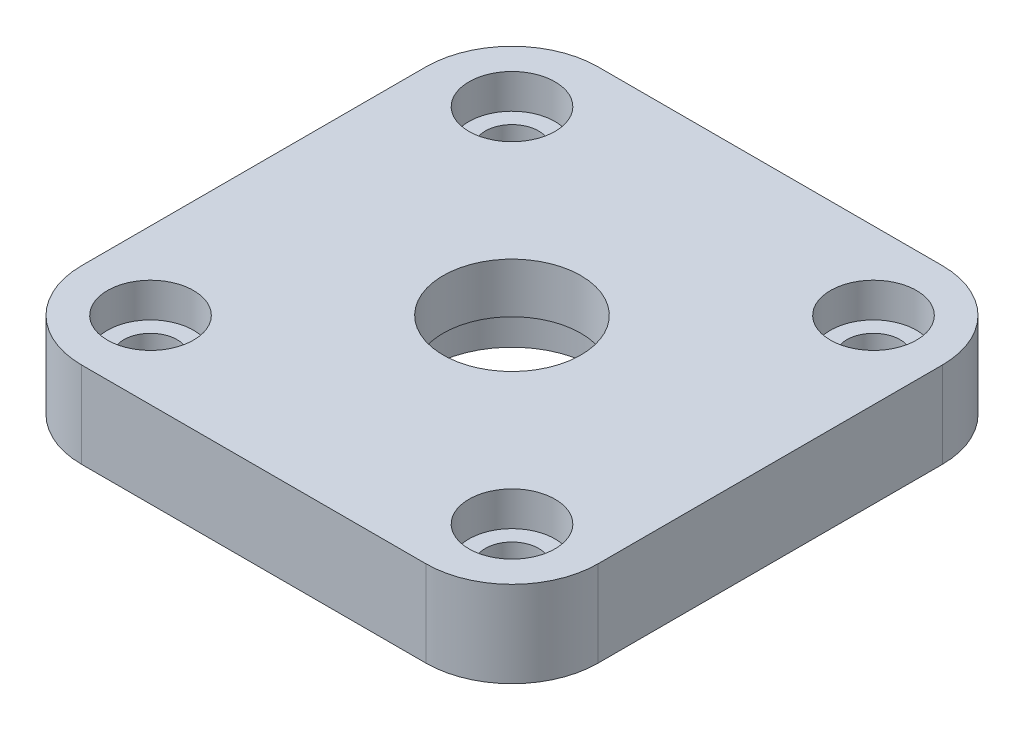
ISO-10303-21;
HEADER;
FILE_DESCRIPTION(('STEP AP214'),'2;1');
FILE_NAME('part.step','',(''),(''),'','','');
FILE_SCHEMA(('AUTOMOTIVE_DESIGN { 1 0 10303 214 1 1 1 1 }'));
ENDSEC;
DATA;
#1=APPLICATION_CONTEXT('core data for automotive mechanical design processes');
#2=APPLICATION_PROTOCOL_DEFINITION('international standard','automotive_design',2000,#1);
#3=PRODUCT_CONTEXT('',#1,'mechanical');
#4=PRODUCT('Part','Part','',(#3));
#5=PRODUCT_RELATED_PRODUCT_CATEGORY('part','',(#4));
#6=PRODUCT_DEFINITION_FORMATION('','',#4);
#7=PRODUCT_DEFINITION_CONTEXT('part definition',#1,'design');
#8=PRODUCT_DEFINITION('design','',#6,#7);
#9=PRODUCT_DEFINITION_SHAPE('','',#8);
#10=(LENGTH_UNIT() NAMED_UNIT(*) SI_UNIT(.MILLI.,.METRE.));
#11=(NAMED_UNIT(*) PLANE_ANGLE_UNIT() SI_UNIT($,.RADIAN.));
#12=(NAMED_UNIT(*) SI_UNIT($,.STERADIAN.) SOLID_ANGLE_UNIT());
#13=UNCERTAINTY_MEASURE_WITH_UNIT(LENGTH_MEASURE(1.E-05),#10,'distance_accuracy_value','');
#14=(GEOMETRIC_REPRESENTATION_CONTEXT(3) GLOBAL_UNCERTAINTY_ASSIGNED_CONTEXT((#13)) GLOBAL_UNIT_ASSIGNED_CONTEXT((#10,
#11,#12)) REPRESENTATION_CONTEXT('',''));
#15=CARTESIAN_POINT('',(0.,0.,0.));
#16=DIRECTION('',(0.,0.,1.));
#17=DIRECTION('',(1.,0.,0.));
#18=AXIS2_PLACEMENT_3D('',#15,#16,#17);
#19=CARTESIAN_POINT('',(-10.5,0.,-10.5));
#20=DIRECTION('',(0.,1.,0.));
#21=DIRECTION('',(0.,0.,1.));
#22=AXIS2_PLACEMENT_3D('',#19,#20,#21);
#23=CYLINDRICAL_SURFACE('',#22,1.55);
#24=CARTESIAN_POINT('',(-10.5,0.,-10.5));
#25=DIRECTION('',(0.,1.,0.));
#26=DIRECTION('',(0.,0.,1.));
#27=AXIS2_PLACEMENT_3D('',#24,#25,#26);
#28=CIRCLE('',#27,1.55);
#29=CARTESIAN_POINT('',(-10.5,0.,-8.94999999999995));
#30=VERTEX_POINT('',#29);
#31=EDGE_CURVE('E192',#30,#30,#28,.T.);
#32=ORIENTED_EDGE('',*,*,#31,.F.);
#33=EDGE_LOOP('',(#32));
#34=FACE_BOUND('',#33,.T.);
#35=CARTESIAN_POINT('',(-10.5,3.,-10.5));
#36=DIRECTION('',(0.,1.,0.));
#37=DIRECTION('',(0.,0.,1.));
#38=AXIS2_PLACEMENT_3D('',#35,#36,#37);
#39=CIRCLE('',#38,1.55);
#40=CARTESIAN_POINT('',(-10.5,3.,-8.94999999999995));
#41=VERTEX_POINT('',#40);
#42=EDGE_CURVE('E42',#41,#41,#39,.F.);
#43=ORIENTED_EDGE('',*,*,#42,.F.);
#44=EDGE_LOOP('',(#43));
#45=FACE_BOUND('',#44,.T.);
#46=ADVANCED_FACE('F38',(#34,#45),#23,.F.);
#47=CARTESIAN_POINT('',(10.5,0.,-10.5000000000001));
#48=DIRECTION('',(0.,1.,0.));
#49=DIRECTION('',(0.,0.,1.));
#50=AXIS2_PLACEMENT_3D('',#47,#48,#49);
#51=CYLINDRICAL_SURFACE('',#50,1.55);
#52=CARTESIAN_POINT('',(10.5,0.,-10.5000000000001));
#53=DIRECTION('',(0.,1.,0.));
#54=DIRECTION('',(0.,0.,1.));
#55=AXIS2_PLACEMENT_3D('',#52,#53,#54);
#56=CIRCLE('',#55,1.55);
#57=CARTESIAN_POINT('',(10.5,0.,-8.95000000000007));
#58=VERTEX_POINT('',#57);
#59=EDGE_CURVE('E189',#58,#58,#56,.T.);
#60=ORIENTED_EDGE('',*,*,#59,.F.);
#61=EDGE_LOOP('',(#60));
#62=FACE_BOUND('',#61,.T.);
#63=CARTESIAN_POINT('',(10.5,3.,-10.5000000000001));
#64=DIRECTION('',(0.,1.,0.));
#65=DIRECTION('',(0.,0.,1.));
#66=AXIS2_PLACEMENT_3D('',#63,#64,#65);
#67=CIRCLE('',#66,1.55);
#68=CARTESIAN_POINT('',(10.5,3.,-8.95000000000007));
#69=VERTEX_POINT('',#68);
#70=EDGE_CURVE('E173',#69,#69,#67,.F.);
#71=ORIENTED_EDGE('',*,*,#70,.F.);
#72=EDGE_LOOP('',(#71));
#73=FACE_BOUND('',#72,.T.);
#74=ADVANCED_FACE('F231',(#62,#73),#51,.F.);
#75=CARTESIAN_POINT('',(10.5,0.,10.5));
#76=DIRECTION('',(0.,1.,0.));
#77=DIRECTION('',(0.,0.,1.));
#78=AXIS2_PLACEMENT_3D('',#75,#76,#77);
#79=CYLINDRICAL_SURFACE('',#78,1.55);
#80=CARTESIAN_POINT('',(10.5,0.,10.5));
#81=DIRECTION('',(0.,1.,0.));
#82=DIRECTION('',(0.,0.,1.));
#83=AXIS2_PLACEMENT_3D('',#80,#81,#82);
#84=CIRCLE('',#83,1.55);
#85=CARTESIAN_POINT('',(10.5,0.,12.05));
#86=VERTEX_POINT('',#85);
#87=EDGE_CURVE('E193',#86,#86,#84,.T.);
#88=ORIENTED_EDGE('',*,*,#87,.F.);
#89=EDGE_LOOP('',(#88));
#90=FACE_BOUND('',#89,.T.);
#91=CARTESIAN_POINT('',(10.5,3.,10.5));
#92=DIRECTION('',(0.,1.,0.));
#93=DIRECTION('',(0.,0.,1.));
#94=AXIS2_PLACEMENT_3D('',#91,#92,#93);
#95=CIRCLE('',#94,1.55);
#96=CARTESIAN_POINT('',(10.5,3.,12.05));
#97=VERTEX_POINT('',#96);
#98=EDGE_CURVE('E170',#97,#97,#95,.F.);
#99=ORIENTED_EDGE('',*,*,#98,.F.);
#100=EDGE_LOOP('',(#99));
#101=FACE_BOUND('',#100,.T.);
#102=ADVANCED_FACE('F237',(#90,#101),#79,.F.);
#103=CARTESIAN_POINT('',(-10.5,0.,10.5));
#104=DIRECTION('',(0.,1.,0.));
#105=DIRECTION('',(0.,0.,1.));
#106=AXIS2_PLACEMENT_3D('',#103,#104,#105);
#107=CYLINDRICAL_SURFACE('',#106,1.55);
#108=CARTESIAN_POINT('',(-10.5,0.,10.5));
#109=DIRECTION('',(0.,1.,0.));
#110=DIRECTION('',(0.,0.,1.));
#111=AXIS2_PLACEMENT_3D('',#108,#109,#110);
#112=CIRCLE('',#111,1.55);
#113=CARTESIAN_POINT('',(-10.5,0.,12.05));
#114=VERTEX_POINT('',#113);
#115=EDGE_CURVE('E144',#114,#114,#112,.T.);
#116=ORIENTED_EDGE('',*,*,#115,.F.);
#117=EDGE_LOOP('',(#116));
#118=FACE_BOUND('',#117,.T.);
#119=CARTESIAN_POINT('',(-10.5,3.,10.5));
#120=DIRECTION('',(0.,1.,0.));
#121=DIRECTION('',(0.,0.,1.));
#122=AXIS2_PLACEMENT_3D('',#119,#120,#121);
#123=CIRCLE('',#122,1.55);
#124=CARTESIAN_POINT('',(-10.5,3.,12.05));
#125=VERTEX_POINT('',#124);
#126=EDGE_CURVE('E167',#125,#125,#123,.F.);
#127=ORIENTED_EDGE('',*,*,#126,.F.);
#128=EDGE_LOOP('',(#127));
#129=FACE_BOUND('',#128,.T.);
#130=ADVANCED_FACE('F244',(#118,#129),#107,.F.);
#131=CARTESIAN_POINT('',(0.,0.,0.));
#132=DIRECTION('',(0.,1.,0.));
#133=DIRECTION('',(0.,0.,1.));
#134=AXIS2_PLACEMENT_3D('',#131,#132,#133);
#135=CYLINDRICAL_SURFACE('',#134,4.);
#136=CARTESIAN_POINT('',(0.,5.,0.));
#137=DIRECTION('',(0.,-1.,0.));
#138=DIRECTION('',(0.,0.,-1.));
#139=AXIS2_PLACEMENT_3D('',#136,#137,#138);
#140=CIRCLE('',#139,4.);
#141=CARTESIAN_POINT('',(0.,5.,-4.));
#142=VERTEX_POINT('',#141);
#143=EDGE_CURVE('E200',#142,#142,#140,.T.);
#144=ORIENTED_EDGE('',*,*,#143,.F.);
#145=EDGE_LOOP('',(#144));
#146=FACE_BOUND('',#145,.T.);
#147=CARTESIAN_POINT('',(0.,2.1,0.));
#148=DIRECTION('',(0.,-1.,0.));
#149=DIRECTION('',(0.,0.,-1.));
#150=AXIS2_PLACEMENT_3D('',#147,#148,#149);
#151=CIRCLE('',#150,4.);
#152=CARTESIAN_POINT('',(0.,2.1,-4.));
#153=VERTEX_POINT('',#152);
#154=EDGE_CURVE('E141',#153,#153,#151,.F.);
#155=ORIENTED_EDGE('',*,*,#154,.F.);
#156=EDGE_LOOP('',(#155));
#157=FACE_BOUND('',#156,.T.);
#158=ADVANCED_FACE('F246',(#146,#157),#135,.F.);
#159=CARTESIAN_POINT('',(15.,5.,15.));
#160=DIRECTION('',(-1.,0.,0.));
#161=DIRECTION('',(0.,0.,1.));
#162=AXIS2_PLACEMENT_3D('',#159,#160,#161);
#163=PLANE('',#162);
#164=DIRECTION('',(0.,0.,-1.));
#165=VECTOR('',#164,1.);
#166=CARTESIAN_POINT('',(15.,0.,15.));
#167=LINE('',#166,#165);
#168=CARTESIAN_POINT('',(15.,0.,10.));
#169=VERTEX_POINT('',#168);
#170=CARTESIAN_POINT('',(15.,0.,-10.));
#171=VERTEX_POINT('',#170);
#172=EDGE_CURVE('E202',#169,#171,#167,.T.);
#173=ORIENTED_EDGE('',*,*,#172,.T.);
#174=DIRECTION('',(0.,-1.,0.));
#175=VECTOR('',#174,1.);
#176=CARTESIAN_POINT('',(15.,5.,-10.));
#177=LINE('',#176,#175);
#178=CARTESIAN_POINT('',(15.,5.,-10.));
#179=VERTEX_POINT('',#178);
#180=EDGE_CURVE('E11',#171,#179,#177,.F.);
#181=ORIENTED_EDGE('',*,*,#180,.T.);
#182=DIRECTION('',(0.,0.,-1.));
#183=VECTOR('',#182,1.);
#184=CARTESIAN_POINT('',(15.,5.,15.));
#185=LINE('',#184,#183);
#186=CARTESIAN_POINT('',(15.,5.,10.));
#187=VERTEX_POINT('',#186);
#188=EDGE_CURVE('E132',#187,#179,#185,.T.);
#189=ORIENTED_EDGE('',*,*,#188,.F.);
#190=DIRECTION('',(0.,-1.,0.));
#191=VECTOR('',#190,1.);
#192=CARTESIAN_POINT('',(15.,5.,10.));
#193=LINE('',#192,#191);
#194=EDGE_CURVE('E47',#187,#169,#193,.T.);
#195=ORIENTED_EDGE('',*,*,#194,.T.);
#196=EDGE_LOOP('',(#173,#181,#189,#195));
#197=FACE_BOUND('',#196,.T.);
#198=ADVANCED_FACE('F228',(#197),#163,.F.);
#199=CARTESIAN_POINT('',(-15.,5.,-15.));
#200=DIRECTION('',(0.,0.,1.));
#201=DIRECTION('',(1.,0.,0.));
#202=AXIS2_PLACEMENT_3D('',#199,#200,#201);
#203=PLANE('',#202);
#204=DIRECTION('',(-1.,0.,0.));
#205=VECTOR('',#204,1.);
#206=CARTESIAN_POINT('',(-15.,0.,-15.));
#207=LINE('',#206,#205);
#208=CARTESIAN_POINT('',(10.,0.,-15.));
#209=VERTEX_POINT('',#208);
#210=CARTESIAN_POINT('',(-10.,0.,-15.));
#211=VERTEX_POINT('',#210);
#212=EDGE_CURVE('E137',#209,#211,#207,.T.);
#213=ORIENTED_EDGE('',*,*,#212,.T.);
#214=DIRECTION('',(0.,-1.,0.));
#215=VECTOR('',#214,1.);
#216=CARTESIAN_POINT('',(-10.,5.,-15.));
#217=LINE('',#216,#215);
#218=CARTESIAN_POINT('',(-10.,5.,-15.));
#219=VERTEX_POINT('',#218);
#220=EDGE_CURVE('E55',#211,#219,#217,.F.);
#221=ORIENTED_EDGE('',*,*,#220,.T.);
#222=DIRECTION('',(-1.,0.,0.));
#223=VECTOR('',#222,1.);
#224=CARTESIAN_POINT('',(-15.,5.,-15.));
#225=LINE('',#224,#223);
#226=CARTESIAN_POINT('',(10.,5.,-15.));
#227=VERTEX_POINT('',#226);
#228=EDGE_CURVE('E135',#227,#219,#225,.T.);
#229=ORIENTED_EDGE('',*,*,#228,.F.);
#230=DIRECTION('',(0.,-1.,0.));
#231=VECTOR('',#230,1.);
#232=CARTESIAN_POINT('',(10.,5.,-15.));
#233=LINE('',#232,#231);
#234=EDGE_CURVE('E161',#227,#209,#233,.T.);
#235=ORIENTED_EDGE('',*,*,#234,.T.);
#236=EDGE_LOOP('',(#213,#221,#229,#235));
#237=FACE_BOUND('',#236,.T.);
#238=ADVANCED_FACE('F211',(#237),#203,.F.);
#239=CARTESIAN_POINT('',(-15.,5.,15.));
#240=DIRECTION('',(1.,0.,0.));
#241=DIRECTION('',(0.,0.,-1.));
#242=AXIS2_PLACEMENT_3D('',#239,#240,#241);
#243=PLANE('',#242);
#244=DIRECTION('',(0.,0.,1.));
#245=VECTOR('',#244,1.);
#246=CARTESIAN_POINT('',(-15.,0.,15.));
#247=LINE('',#246,#245);
#248=CARTESIAN_POINT('',(-15.,0.,-10.));
#249=VERTEX_POINT('',#248);
#250=CARTESIAN_POINT('',(-15.,0.,10.));
#251=VERTEX_POINT('',#250);
#252=EDGE_CURVE('E133',#249,#251,#247,.T.);
#253=ORIENTED_EDGE('',*,*,#252,.T.);
#254=DIRECTION('',(0.,-1.,0.));
#255=VECTOR('',#254,1.);
#256=CARTESIAN_POINT('',(-15.,5.,10.));
#257=LINE('',#256,#255);
#258=CARTESIAN_POINT('',(-15.,5.,10.));
#259=VERTEX_POINT('',#258);
#260=EDGE_CURVE('E111',#251,#259,#257,.F.);
#261=ORIENTED_EDGE('',*,*,#260,.T.);
#262=DIRECTION('',(0.,0.,1.));
#263=VECTOR('',#262,1.);
#264=CARTESIAN_POINT('',(-15.,5.,15.));
#265=LINE('',#264,#263);
#266=CARTESIAN_POINT('',(-15.,5.,-10.));
#267=VERTEX_POINT('',#266);
#268=EDGE_CURVE('E205',#267,#259,#265,.T.);
#269=ORIENTED_EDGE('',*,*,#268,.F.);
#270=DIRECTION('',(0.,-1.,0.));
#271=VECTOR('',#270,1.);
#272=CARTESIAN_POINT('',(-15.,5.,-10.));
#273=LINE('',#272,#271);
#274=EDGE_CURVE('E116',#267,#249,#273,.T.);
#275=ORIENTED_EDGE('',*,*,#274,.T.);
#276=EDGE_LOOP('',(#253,#261,#269,#275));
#277=FACE_BOUND('',#276,.T.);
#278=ADVANCED_FACE('F220',(#277),#243,.F.);
#279=CARTESIAN_POINT('',(-15.,5.,15.));
#280=DIRECTION('',(0.,0.,-1.));
#281=DIRECTION('',(-1.,0.,0.));
#282=AXIS2_PLACEMENT_3D('',#279,#280,#281);
#283=PLANE('',#282);
#284=DIRECTION('',(1.,0.,0.));
#285=VECTOR('',#284,1.);
#286=CARTESIAN_POINT('',(-15.,5.,15.));
#287=LINE('',#286,#285);
#288=CARTESIAN_POINT('',(-10.,5.,15.));
#289=VERTEX_POINT('',#288);
#290=CARTESIAN_POINT('',(10.,5.,15.));
#291=VERTEX_POINT('',#290);
#292=EDGE_CURVE('E126',#289,#291,#287,.T.);
#293=ORIENTED_EDGE('',*,*,#292,.F.);
#294=DIRECTION('',(0.,-1.,0.));
#295=VECTOR('',#294,1.);
#296=CARTESIAN_POINT('',(-10.,5.,15.));
#297=LINE('',#296,#295);
#298=CARTESIAN_POINT('',(-10.,0.,15.));
#299=VERTEX_POINT('',#298);
#300=EDGE_CURVE('E110',#289,#299,#297,.T.);
#301=ORIENTED_EDGE('',*,*,#300,.T.);
#302=DIRECTION('',(1.,0.,0.));
#303=VECTOR('',#302,1.);
#304=CARTESIAN_POINT('',(-15.,0.,15.));
#305=LINE('',#304,#303);
#306=CARTESIAN_POINT('',(10.,0.,15.));
#307=VERTEX_POINT('',#306);
#308=EDGE_CURVE('E123',#299,#307,#305,.T.);
#309=ORIENTED_EDGE('',*,*,#308,.T.);
#310=DIRECTION('',(0.,-1.,0.));
#311=VECTOR('',#310,1.);
#312=CARTESIAN_POINT('',(10.,5.,15.));
#313=LINE('',#312,#311);
#314=EDGE_CURVE('E128',#307,#291,#313,.F.);
#315=ORIENTED_EDGE('',*,*,#314,.T.);
#316=EDGE_LOOP('',(#293,#301,#309,#315));
#317=FACE_BOUND('',#316,.T.);
#318=ADVANCED_FACE('F122',(#317),#283,.F.);
#319=CARTESIAN_POINT('',(0.,5.,0.));
#320=DIRECTION('',(0.,-1.,0.));
#321=DIRECTION('',(0.,0.,-1.));
#322=AXIS2_PLACEMENT_3D('',#319,#320,#321);
#323=PLANE('',#322);
#324=CARTESIAN_POINT('',(10.5,5.,-10.5000000000001));
#325=DIRECTION('',(0.,1.,0.));
#326=DIRECTION('',(0.,0.,1.));
#327=AXIS2_PLACEMENT_3D('',#324,#325,#326);
#328=CIRCLE('',#327,2.5);
#329=CARTESIAN_POINT('',(10.5,5.,-8.00000000000006));
#330=VERTEX_POINT('',#329);
#331=EDGE_CURVE('E490',#330,#330,#328,.T.);
#332=ORIENTED_EDGE('',*,*,#331,.F.);
#333=EDGE_LOOP('',(#332));
#334=FACE_BOUND('',#333,.T.);
#335=CARTESIAN_POINT('',(-10.5,5.,10.5));
#336=DIRECTION('',(0.,1.,0.));
#337=DIRECTION('',(0.,0.,1.));
#338=AXIS2_PLACEMENT_3D('',#335,#336,#337);
#339=CIRCLE('',#338,2.5);
#340=CARTESIAN_POINT('',(-10.5,5.,13.));
#341=VERTEX_POINT('',#340);
#342=EDGE_CURVE('E493',#341,#341,#339,.T.);
#343=ORIENTED_EDGE('',*,*,#342,.F.);
#344=EDGE_LOOP('',(#343));
#345=FACE_BOUND('',#344,.T.);
#346=CARTESIAN_POINT('',(10.5,5.,10.5));
#347=DIRECTION('',(0.,1.,0.));
#348=DIRECTION('',(0.,0.,1.));
#349=AXIS2_PLACEMENT_3D('',#346,#347,#348);
#350=CIRCLE('',#349,2.5);
#351=CARTESIAN_POINT('',(10.5,5.,13.));
#352=VERTEX_POINT('',#351);
#353=EDGE_CURVE('E502',#352,#352,#350,.T.);
#354=ORIENTED_EDGE('',*,*,#353,.F.);
#355=EDGE_LOOP('',(#354));
#356=FACE_BOUND('',#355,.T.);
#357=CARTESIAN_POINT('',(-10.5,5.,-10.5));
#358=DIRECTION('',(0.,1.,0.));
#359=DIRECTION('',(0.,0.,1.));
#360=AXIS2_PLACEMENT_3D('',#357,#358,#359);
#361=CIRCLE('',#360,2.5);
#362=CARTESIAN_POINT('',(-10.5,5.,-7.99999999999995));
#363=VERTEX_POINT('',#362);
#364=EDGE_CURVE('E485',#363,#363,#361,.T.);
#365=ORIENTED_EDGE('',*,*,#364,.F.);
#366=EDGE_LOOP('',(#365));
#367=FACE_BOUND('',#366,.T.);
#368=ORIENTED_EDGE('',*,*,#143,.T.);
#369=EDGE_LOOP('',(#368));
#370=FACE_BOUND('',#369,.T.);
#371=ORIENTED_EDGE('',*,*,#268,.T.);
#372=CARTESIAN_POINT('',(-10.,5.,10.));
#373=DIRECTION('',(0.,-1.,0.));
#374=DIRECTION('',(0.,0.,-1.));
#375=AXIS2_PLACEMENT_3D('',#372,#373,#374);
#376=CIRCLE('',#375,5.);
#377=EDGE_CURVE('E159',#259,#289,#376,.F.);
#378=ORIENTED_EDGE('',*,*,#377,.T.);
#379=ORIENTED_EDGE('',*,*,#292,.T.);
#380=CARTESIAN_POINT('',(10.,5.,10.));
#381=DIRECTION('',(0.,-1.,0.));
#382=DIRECTION('',(0.,0.,-1.));
#383=AXIS2_PLACEMENT_3D('',#380,#381,#382);
#384=CIRCLE('',#383,5.);
#385=EDGE_CURVE('E154',#291,#187,#384,.F.);
#386=ORIENTED_EDGE('',*,*,#385,.T.);
#387=ORIENTED_EDGE('',*,*,#188,.T.);
#388=CARTESIAN_POINT('',(10.,5.,-10.));
#389=DIRECTION('',(0.,-1.,0.));
#390=DIRECTION('',(0.,0.,-1.));
#391=AXIS2_PLACEMENT_3D('',#388,#389,#390);
#392=CIRCLE('',#391,5.);
#393=EDGE_CURVE('E62',#179,#227,#392,.F.);
#394=ORIENTED_EDGE('',*,*,#393,.T.);
#395=ORIENTED_EDGE('',*,*,#228,.T.);
#396=CARTESIAN_POINT('',(-10.,5.,-10.));
#397=DIRECTION('',(0.,-1.,0.));
#398=DIRECTION('',(0.,0.,-1.));
#399=AXIS2_PLACEMENT_3D('',#396,#397,#398);
#400=CIRCLE('',#399,5.);
#401=EDGE_CURVE('E157',#219,#267,#400,.F.);
#402=ORIENTED_EDGE('',*,*,#401,.T.);
#403=EDGE_LOOP('',(#371,#378,#379,#386,#387,#394,#395,#402));
#404=FACE_BOUND('',#403,.T.);
#405=ADVANCED_FACE('F218',(#334,#345,#356,#367,#370,#404),#323,.F.);
#406=CARTESIAN_POINT('',(0.,0.,0.));
#407=DIRECTION('',(0.,-1.,0.));
#408=DIRECTION('',(0.,0.,-1.));
#409=AXIS2_PLACEMENT_3D('',#406,#407,#408);
#410=PLANE('',#409);
#411=CARTESIAN_POINT('',(0.,0.,0.));
#412=DIRECTION('',(0.,-1.,0.));
#413=DIRECTION('',(0.,0.,-1.));
#414=AXIS2_PLACEMENT_3D('',#411,#412,#413);
#415=CIRCLE('',#414,4.8);
#416=CARTESIAN_POINT('',(0.,0.,-4.8));
#417=VERTEX_POINT('',#416);
#418=EDGE_CURVE('E178',#417,#417,#415,.T.);
#419=ORIENTED_EDGE('',*,*,#418,.F.);
#420=EDGE_LOOP('',(#419));
#421=FACE_BOUND('',#420,.T.);
#422=ORIENTED_EDGE('',*,*,#115,.T.);
#423=EDGE_LOOP('',(#422));
#424=FACE_BOUND('',#423,.T.);
#425=ORIENTED_EDGE('',*,*,#87,.T.);
#426=EDGE_LOOP('',(#425));
#427=FACE_BOUND('',#426,.T.);
#428=ORIENTED_EDGE('',*,*,#59,.T.);
#429=EDGE_LOOP('',(#428));
#430=FACE_BOUND('',#429,.T.);
#431=ORIENTED_EDGE('',*,*,#31,.T.);
#432=EDGE_LOOP('',(#431));
#433=FACE_BOUND('',#432,.T.);
#434=ORIENTED_EDGE('',*,*,#308,.F.);
#435=CARTESIAN_POINT('',(-10.,0.,10.));
#436=DIRECTION('',(0.,-1.,0.));
#437=DIRECTION('',(0.,0.,-1.));
#438=AXIS2_PLACEMENT_3D('',#435,#436,#437);
#439=CIRCLE('',#438,5.);
#440=EDGE_CURVE('E106',#299,#251,#439,.T.);
#441=ORIENTED_EDGE('',*,*,#440,.T.);
#442=ORIENTED_EDGE('',*,*,#252,.F.);
#443=CARTESIAN_POINT('',(-10.,0.,-10.));
#444=DIRECTION('',(0.,-1.,0.));
#445=DIRECTION('',(0.,0.,-1.));
#446=AXIS2_PLACEMENT_3D('',#443,#444,#445);
#447=CIRCLE('',#446,5.);
#448=EDGE_CURVE('E117',#249,#211,#447,.T.);
#449=ORIENTED_EDGE('',*,*,#448,.T.);
#450=ORIENTED_EDGE('',*,*,#212,.F.);
#451=CARTESIAN_POINT('',(10.,0.,-10.));
#452=DIRECTION('',(0.,-1.,0.));
#453=DIRECTION('',(0.,0.,-1.));
#454=AXIS2_PLACEMENT_3D('',#451,#452,#453);
#455=CIRCLE('',#454,5.);
#456=EDGE_CURVE('E148',#209,#171,#455,.T.);
#457=ORIENTED_EDGE('',*,*,#456,.T.);
#458=ORIENTED_EDGE('',*,*,#172,.F.);
#459=CARTESIAN_POINT('',(10.,0.,10.));
#460=DIRECTION('',(0.,-1.,0.));
#461=DIRECTION('',(0.,0.,-1.));
#462=AXIS2_PLACEMENT_3D('',#459,#460,#461);
#463=CIRCLE('',#462,5.);
#464=EDGE_CURVE('E127',#169,#307,#463,.T.);
#465=ORIENTED_EDGE('',*,*,#464,.T.);
#466=EDGE_LOOP('',(#434,#441,#442,#449,#450,#457,#458,#465));
#467=FACE_BOUND('',#466,.T.);
#468=ADVANCED_FACE('F130',(#421,#424,#427,#430,#433,#467),#410,.T.);
#469=CARTESIAN_POINT('',(0.,2.1,0.));
#470=DIRECTION('',(0.,-1.,0.));
#471=DIRECTION('',(0.,0.,-1.));
#472=AXIS2_PLACEMENT_3D('',#469,#470,#471);
#473=PLANE('',#472);
#474=CARTESIAN_POINT('',(0.,2.1,0.));
#475=DIRECTION('',(0.,-1.,0.));
#476=DIRECTION('',(0.,0.,-1.));
#477=AXIS2_PLACEMENT_3D('',#474,#475,#476);
#478=CIRCLE('',#477,4.8);
#479=CARTESIAN_POINT('',(0.,2.1,-4.8));
#480=VERTEX_POINT('',#479);
#481=EDGE_CURVE('E145',#480,#480,#478,.T.);
#482=ORIENTED_EDGE('',*,*,#481,.T.);
#483=EDGE_LOOP('',(#482));
#484=FACE_BOUND('',#483,.T.);
#485=ORIENTED_EDGE('',*,*,#154,.T.);
#486=EDGE_LOOP('',(#485));
#487=FACE_BOUND('',#486,.T.);
#488=ADVANCED_FACE('F254',(#484,#487),#473,.T.);
#489=CARTESIAN_POINT('',(0.,2.1,0.));
#490=DIRECTION('',(0.,-1.,0.));
#491=DIRECTION('',(0.,0.,-1.));
#492=AXIS2_PLACEMENT_3D('',#489,#490,#491);
#493=CYLINDRICAL_SURFACE('',#492,4.8);
#494=ORIENTED_EDGE('',*,*,#481,.F.);
#495=EDGE_LOOP('',(#494));
#496=FACE_BOUND('',#495,.T.);
#497=ORIENTED_EDGE('',*,*,#418,.T.);
#498=EDGE_LOOP('',(#497));
#499=FACE_BOUND('',#498,.T.);
#500=ADVANCED_FACE('F259',(#496,#499),#493,.F.);
#501=CARTESIAN_POINT('',(-10.,5.,10.));
#502=DIRECTION('',(0.,-1.,0.));
#503=DIRECTION('',(0.,0.,-1.));
#504=AXIS2_PLACEMENT_3D('',#501,#502,#503);
#505=CYLINDRICAL_SURFACE('',#504,5.);
#506=ORIENTED_EDGE('',*,*,#377,.F.);
#507=ORIENTED_EDGE('',*,*,#260,.F.);
#508=ORIENTED_EDGE('',*,*,#440,.F.);
#509=ORIENTED_EDGE('',*,*,#300,.F.);
#510=EDGE_LOOP('',(#506,#507,#508,#509));
#511=FACE_BOUND('',#510,.T.);
#512=ADVANCED_FACE('F109',(#511),#505,.T.);
#513=CARTESIAN_POINT('',(-10.,5.,-10.));
#514=DIRECTION('',(0.,-1.,0.));
#515=DIRECTION('',(0.,0.,-1.));
#516=AXIS2_PLACEMENT_3D('',#513,#514,#515);
#517=CYLINDRICAL_SURFACE('',#516,5.);
#518=ORIENTED_EDGE('',*,*,#401,.F.);
#519=ORIENTED_EDGE('',*,*,#220,.F.);
#520=ORIENTED_EDGE('',*,*,#448,.F.);
#521=ORIENTED_EDGE('',*,*,#274,.F.);
#522=EDGE_LOOP('',(#518,#519,#520,#521));
#523=FACE_BOUND('',#522,.T.);
#524=ADVANCED_FACE('F215',(#523),#517,.T.);
#525=CARTESIAN_POINT('',(10.,5.,-10.));
#526=DIRECTION('',(0.,-1.,0.));
#527=DIRECTION('',(0.,0.,-1.));
#528=AXIS2_PLACEMENT_3D('',#525,#526,#527);
#529=CYLINDRICAL_SURFACE('',#528,5.);
#530=ORIENTED_EDGE('',*,*,#393,.F.);
#531=ORIENTED_EDGE('',*,*,#180,.F.);
#532=ORIENTED_EDGE('',*,*,#456,.F.);
#533=ORIENTED_EDGE('',*,*,#234,.F.);
#534=EDGE_LOOP('',(#530,#531,#532,#533));
#535=FACE_BOUND('',#534,.T.);
#536=ADVANCED_FACE('F324',(#535),#529,.T.);
#537=CARTESIAN_POINT('',(10.,5.,10.));
#538=DIRECTION('',(0.,-1.,0.));
#539=DIRECTION('',(0.,0.,-1.));
#540=AXIS2_PLACEMENT_3D('',#537,#538,#539);
#541=CYLINDRICAL_SURFACE('',#540,5.);
#542=ORIENTED_EDGE('',*,*,#385,.F.);
#543=ORIENTED_EDGE('',*,*,#314,.F.);
#544=ORIENTED_EDGE('',*,*,#464,.F.);
#545=ORIENTED_EDGE('',*,*,#194,.F.);
#546=EDGE_LOOP('',(#542,#543,#544,#545));
#547=FACE_BOUND('',#546,.T.);
#548=ADVANCED_FACE('F40',(#547),#541,.T.);
#549=CARTESIAN_POINT('',(-10.5,3.,10.5));
#550=DIRECTION('',(0.,1.,0.));
#551=DIRECTION('',(0.,0.,1.));
#552=AXIS2_PLACEMENT_3D('',#549,#550,#551);
#553=PLANE('',#552);
#554=CARTESIAN_POINT('',(-10.5,3.,10.5));
#555=DIRECTION('',(0.,1.,0.));
#556=DIRECTION('',(0.,0.,1.));
#557=AXIS2_PLACEMENT_3D('',#554,#555,#556);
#558=CIRCLE('',#557,2.5);
#559=CARTESIAN_POINT('',(-10.5,3.,13.));
#560=VERTEX_POINT('',#559);
#561=EDGE_CURVE('E496',#560,#560,#558,.T.);
#562=ORIENTED_EDGE('',*,*,#561,.T.);
#563=EDGE_LOOP('',(#562));
#564=FACE_BOUND('',#563,.T.);
#565=ORIENTED_EDGE('',*,*,#126,.T.);
#566=EDGE_LOOP('',(#565));
#567=FACE_BOUND('',#566,.T.);
#568=ADVANCED_FACE('F288',(#564,#567),#553,.T.);
#569=CARTESIAN_POINT('',(-10.5,3.,10.5));
#570=DIRECTION('',(0.,1.,0.));
#571=DIRECTION('',(0.,0.,1.));
#572=AXIS2_PLACEMENT_3D('',#569,#570,#571);
#573=CYLINDRICAL_SURFACE('',#572,2.5);
#574=ORIENTED_EDGE('',*,*,#561,.F.);
#575=EDGE_LOOP('',(#574));
#576=FACE_BOUND('',#575,.T.);
#577=ORIENTED_EDGE('',*,*,#342,.T.);
#578=EDGE_LOOP('',(#577));
#579=FACE_BOUND('',#578,.T.);
#580=ADVANCED_FACE('F278',(#576,#579),#573,.F.);
#581=CARTESIAN_POINT('',(10.5,3.,10.5));
#582=DIRECTION('',(0.,1.,0.));
#583=DIRECTION('',(0.,0.,1.));
#584=AXIS2_PLACEMENT_3D('',#581,#582,#583);
#585=PLANE('',#584);
#586=CARTESIAN_POINT('',(10.5,3.,10.5));
#587=DIRECTION('',(0.,1.,0.));
#588=DIRECTION('',(0.,0.,1.));
#589=AXIS2_PLACEMENT_3D('',#586,#587,#588);
#590=CIRCLE('',#589,2.5);
#591=CARTESIAN_POINT('',(10.5,3.,13.));
#592=VERTEX_POINT('',#591);
#593=EDGE_CURVE('E497',#592,#592,#590,.T.);
#594=ORIENTED_EDGE('',*,*,#593,.T.);
#595=EDGE_LOOP('',(#594));
#596=FACE_BOUND('',#595,.T.);
#597=ORIENTED_EDGE('',*,*,#98,.T.);
#598=EDGE_LOOP('',(#597));
#599=FACE_BOUND('',#598,.T.);
#600=ADVANCED_FACE('F275',(#596,#599),#585,.T.);
#601=CARTESIAN_POINT('',(10.5,3.,10.5));
#602=DIRECTION('',(0.,1.,0.));
#603=DIRECTION('',(0.,0.,1.));
#604=AXIS2_PLACEMENT_3D('',#601,#602,#603);
#605=CYLINDRICAL_SURFACE('',#604,2.5);
#606=ORIENTED_EDGE('',*,*,#593,.F.);
#607=EDGE_LOOP('',(#606));
#608=FACE_BOUND('',#607,.T.);
#609=ORIENTED_EDGE('',*,*,#353,.T.);
#610=EDGE_LOOP('',(#609));
#611=FACE_BOUND('',#610,.T.);
#612=ADVANCED_FACE('F277',(#608,#611),#605,.F.);
#613=CARTESIAN_POINT('',(10.5,3.,-10.5000000000001));
#614=DIRECTION('',(0.,1.,0.));
#615=DIRECTION('',(0.,0.,1.));
#616=AXIS2_PLACEMENT_3D('',#613,#614,#615);
#617=PLANE('',#616);
#618=CARTESIAN_POINT('',(10.5,3.,-10.5000000000001));
#619=DIRECTION('',(0.,1.,0.));
#620=DIRECTION('',(0.,0.,1.));
#621=AXIS2_PLACEMENT_3D('',#618,#619,#620);
#622=CIRCLE('',#621,2.5);
#623=CARTESIAN_POINT('',(10.5,3.,-8.00000000000006));
#624=VERTEX_POINT('',#623);
#625=EDGE_CURVE('E487',#624,#624,#622,.T.);
#626=ORIENTED_EDGE('',*,*,#625,.T.);
#627=EDGE_LOOP('',(#626));
#628=FACE_BOUND('',#627,.T.);
#629=ORIENTED_EDGE('',*,*,#70,.T.);
#630=EDGE_LOOP('',(#629));
#631=FACE_BOUND('',#630,.T.);
#632=ADVANCED_FACE('F285',(#628,#631),#617,.T.);
#633=CARTESIAN_POINT('',(10.5,3.,-10.5000000000001));
#634=DIRECTION('',(0.,1.,0.));
#635=DIRECTION('',(0.,0.,1.));
#636=AXIS2_PLACEMENT_3D('',#633,#634,#635);
#637=CYLINDRICAL_SURFACE('',#636,2.5);
#638=ORIENTED_EDGE('',*,*,#625,.F.);
#639=EDGE_LOOP('',(#638));
#640=FACE_BOUND('',#639,.T.);
#641=ORIENTED_EDGE('',*,*,#331,.T.);
#642=EDGE_LOOP('',(#641));
#643=FACE_BOUND('',#642,.T.);
#644=ADVANCED_FACE('F295',(#640,#643),#637,.F.);
#645=CARTESIAN_POINT('',(-10.5,3.,-10.5));
#646=DIRECTION('',(0.,1.,0.));
#647=DIRECTION('',(0.,0.,1.));
#648=AXIS2_PLACEMENT_3D('',#645,#646,#647);
#649=PLANE('',#648);
#650=CARTESIAN_POINT('',(-10.5,3.,-10.5));
#651=DIRECTION('',(0.,1.,0.));
#652=DIRECTION('',(0.,0.,1.));
#653=AXIS2_PLACEMENT_3D('',#650,#651,#652);
#654=CIRCLE('',#653,2.5);
#655=CARTESIAN_POINT('',(-10.5,3.,-7.99999999999995));
#656=VERTEX_POINT('',#655);
#657=EDGE_CURVE('E171',#656,#656,#654,.T.);
#658=ORIENTED_EDGE('',*,*,#657,.T.);
#659=EDGE_LOOP('',(#658));
#660=FACE_BOUND('',#659,.T.);
#661=ORIENTED_EDGE('',*,*,#42,.T.);
#662=EDGE_LOOP('',(#661));
#663=FACE_BOUND('',#662,.T.);
#664=ADVANCED_FACE('F299',(#660,#663),#649,.T.);
#665=CARTESIAN_POINT('',(-10.5,3.,-10.5));
#666=DIRECTION('',(0.,1.,0.));
#667=DIRECTION('',(0.,0.,1.));
#668=AXIS2_PLACEMENT_3D('',#665,#666,#667);
#669=CYLINDRICAL_SURFACE('',#668,2.5);
#670=ORIENTED_EDGE('',*,*,#657,.F.);
#671=EDGE_LOOP('',(#670));
#672=FACE_BOUND('',#671,.T.);
#673=ORIENTED_EDGE('',*,*,#364,.T.);
#674=EDGE_LOOP('',(#673));
#675=FACE_BOUND('',#674,.T.);
#676=ADVANCED_FACE('F306',(#672,#675),#669,.F.);
#677=CLOSED_SHELL('',(#46,#74,#102,#130,#158,#198,#238,#278,#318,#405,#468,#488,#500,#512,#524,
#536,#548,#568,#580,#600,#612,#632,#644,#664,#676));
#678=MANIFOLD_SOLID_BREP('B2',#677);
#679=ADVANCED_BREP_SHAPE_REPRESENTATION('',(#18,#678),#14);
#680=SHAPE_DEFINITION_REPRESENTATION(#9,#679);
ENDSEC;
END-ISO-10303-21;
